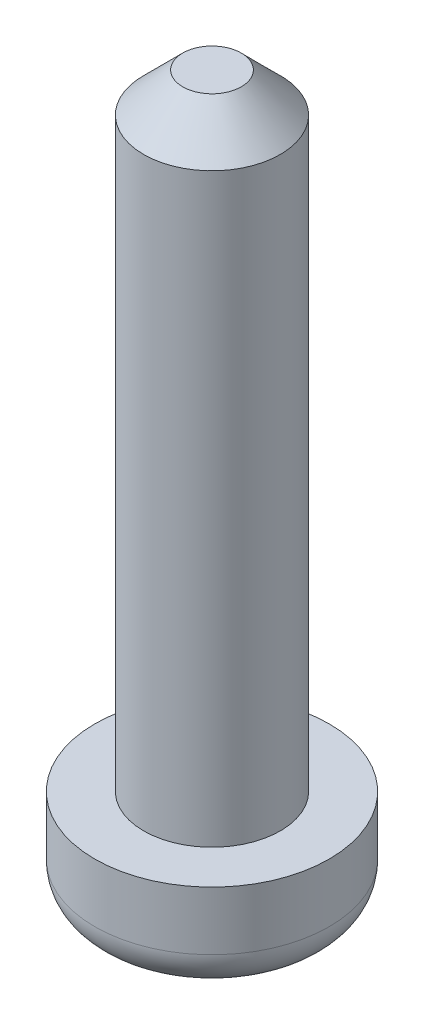
ISO-10303-21;
HEADER;
FILE_DESCRIPTION(('STEP AP214'),'2;1');
FILE_NAME('part.step','',(''),(''),'','','');
FILE_SCHEMA(('AUTOMOTIVE_DESIGN { 1 0 10303 214 1 1 1 1 }'));
ENDSEC;
DATA;
#1=APPLICATION_CONTEXT('core data for automotive mechanical design processes');
#2=APPLICATION_PROTOCOL_DEFINITION('international standard','automotive_design',2000,#1);
#3=PRODUCT_CONTEXT('',#1,'mechanical');
#4=PRODUCT('Part','Part','',(#3));
#5=PRODUCT_RELATED_PRODUCT_CATEGORY('part','',(#4));
#6=PRODUCT_DEFINITION_FORMATION('','',#4);
#7=PRODUCT_DEFINITION_CONTEXT('part definition',#1,'design');
#8=PRODUCT_DEFINITION('design','',#6,#7);
#9=PRODUCT_DEFINITION_SHAPE('','',#8);
#10=(LENGTH_UNIT() NAMED_UNIT(*) SI_UNIT(.MILLI.,.METRE.));
#11=(NAMED_UNIT(*) PLANE_ANGLE_UNIT() SI_UNIT($,.RADIAN.));
#12=(NAMED_UNIT(*) SI_UNIT($,.STERADIAN.) SOLID_ANGLE_UNIT());
#13=UNCERTAINTY_MEASURE_WITH_UNIT(LENGTH_MEASURE(1.E-05),#10,'distance_accuracy_value','');
#14=(GEOMETRIC_REPRESENTATION_CONTEXT(3) GLOBAL_UNCERTAINTY_ASSIGNED_CONTEXT((#13)) GLOBAL_UNIT_ASSIGNED_CONTEXT((#10,
#11,#12)) REPRESENTATION_CONTEXT('',''));
#15=CARTESIAN_POINT('',(0.,0.,0.));
#16=DIRECTION('',(0.,0.,1.));
#17=DIRECTION('',(1.,0.,0.));
#18=AXIS2_PLACEMENT_3D('',#15,#16,#17);
#19=CARTESIAN_POINT('',(0.,-2.5,0.));
#20=DIRECTION('',(0.,1.,0.));
#21=DIRECTION('',(0.,0.,1.));
#22=AXIS2_PLACEMENT_3D('',#19,#20,#21);
#23=PLANE('',#22);
#24=DIRECTION('',(0.,0.,1.));
#25=VECTOR('',#24,1.);
#26=CARTESIAN_POINT('',(0.5,-2.5,-0.5));
#27=LINE('',#26,#25);
#28=CARTESIAN_POINT('',(0.5,-2.5,-1.93649167310371));
#29=VERTEX_POINT('',#28);
#30=CARTESIAN_POINT('',(0.5,-2.5,-0.5));
#31=VERTEX_POINT('',#30);
#32=EDGE_CURVE('E225',#29,#31,#27,.T.);
#33=ORIENTED_EDGE('',*,*,#32,.F.);
#34=CARTESIAN_POINT('',(0.,-2.5,0.));
#35=DIRECTION('',(0.,1.,0.));
#36=DIRECTION('',(0.,0.,1.));
#37=AXIS2_PLACEMENT_3D('',#34,#35,#36);
#38=CIRCLE('',#37,2.);
#39=CARTESIAN_POINT('',(1.93649167310371,-2.5,-0.5));
#40=VERTEX_POINT('',#39);
#41=EDGE_CURVE('E274',#29,#40,#38,.F.);
#42=ORIENTED_EDGE('',*,*,#41,.T.);
#43=DIRECTION('',(1.,0.,0.));
#44=VECTOR('',#43,1.);
#45=CARTESIAN_POINT('',(0.5,-2.5,-0.5));
#46=LINE('',#45,#44);
#47=EDGE_CURVE('E227',#31,#40,#46,.T.);
#48=ORIENTED_EDGE('',*,*,#47,.F.);
#49=EDGE_LOOP('',(#33,#42,#48));
#50=FACE_BOUND('',#49,.T.);
#51=ADVANCED_FACE('F34',(#50),#23,.F.);
#52=DIRECTION('',(-1.,0.,0.));
#53=VECTOR('',#52,1.);
#54=CARTESIAN_POINT('',(0.5,-2.5,0.5));
#55=LINE('',#54,#53);
#56=CARTESIAN_POINT('',(1.93649167310371,-2.5,0.5));
#57=VERTEX_POINT('',#56);
#58=CARTESIAN_POINT('',(0.5,-2.5,0.5));
#59=VERTEX_POINT('',#58);
#60=EDGE_CURVE('E190',#57,#59,#55,.T.);
#61=ORIENTED_EDGE('',*,*,#60,.F.);
#62=CARTESIAN_POINT('',(0.,-2.5,0.));
#63=DIRECTION('',(0.,1.,0.));
#64=DIRECTION('',(0.,0.,1.));
#65=AXIS2_PLACEMENT_3D('',#62,#63,#64);
#66=CIRCLE('',#65,2.);
#67=CARTESIAN_POINT('',(0.5,-2.5,1.93649167310371));
#68=VERTEX_POINT('',#67);
#69=EDGE_CURVE('E272',#57,#68,#66,.F.);
#70=ORIENTED_EDGE('',*,*,#69,.T.);
#71=DIRECTION('',(0.,0.,1.));
#72=VECTOR('',#71,1.);
#73=CARTESIAN_POINT('',(0.5,-2.5,2.));
#74=LINE('',#73,#72);
#75=EDGE_CURVE('E187',#59,#68,#74,.T.);
#76=ORIENTED_EDGE('',*,*,#75,.F.);
#77=EDGE_LOOP('',(#61,#70,#76));
#78=FACE_BOUND('',#77,.T.);
#79=ADVANCED_FACE('F332',(#78),#23,.F.);
#80=DIRECTION('',(0.,0.,-1.));
#81=VECTOR('',#80,1.);
#82=CARTESIAN_POINT('',(-0.5,-2.5,2.));
#83=LINE('',#82,#81);
#84=CARTESIAN_POINT('',(-0.5,-2.5,1.93649167310371));
#85=VERTEX_POINT('',#84);
#86=CARTESIAN_POINT('',(-0.5,-2.5,0.5));
#87=VERTEX_POINT('',#86);
#88=EDGE_CURVE('E168',#85,#87,#83,.T.);
#89=ORIENTED_EDGE('',*,*,#88,.F.);
#90=CARTESIAN_POINT('',(0.,-2.5,0.));
#91=DIRECTION('',(0.,1.,0.));
#92=DIRECTION('',(0.,0.,1.));
#93=AXIS2_PLACEMENT_3D('',#90,#91,#92);
#94=CIRCLE('',#93,2.);
#95=CARTESIAN_POINT('',(-1.93649167310371,-2.5,0.5));
#96=VERTEX_POINT('',#95);
#97=EDGE_CURVE('E270',#85,#96,#94,.F.);
#98=ORIENTED_EDGE('',*,*,#97,.T.);
#99=DIRECTION('',(-1.,0.,0.));
#100=VECTOR('',#99,1.);
#101=CARTESIAN_POINT('',(-2.,-2.5,0.5));
#102=LINE('',#101,#100);
#103=EDGE_CURVE('E219',#87,#96,#102,.T.);
#104=ORIENTED_EDGE('',*,*,#103,.F.);
#105=EDGE_LOOP('',(#89,#98,#104));
#106=FACE_BOUND('',#105,.T.);
#107=ADVANCED_FACE('F339',(#106),#23,.F.);
#108=CARTESIAN_POINT('',(0.,16.,0.));
#109=DIRECTION('',(0.,-1.,0.));
#110=DIRECTION('',(0.,0.,-1.));
#111=AXIS2_PLACEMENT_3D('',#108,#109,#110);
#112=CYLINDRICAL_SURFACE('',#111,1.75);
#113=CARTESIAN_POINT('',(0.,15.,0.));
#114=DIRECTION('',(0.,1.,0.));
#115=DIRECTION('',(0.,0.,1.));
#116=AXIS2_PLACEMENT_3D('',#113,#114,#115);
#117=CIRCLE('',#116,1.75);
#118=CARTESIAN_POINT('',(0.,15.,1.75));
#119=VERTEX_POINT('',#118);
#120=EDGE_CURVE('E11',#119,#119,#117,.F.);
#121=ORIENTED_EDGE('',*,*,#120,.T.);
#122=EDGE_LOOP('',(#121));
#123=FACE_BOUND('',#122,.T.);
#124=CARTESIAN_POINT('',(0.,0.,0.));
#125=DIRECTION('',(0.,1.,0.));
#126=DIRECTION('',(0.,0.,1.));
#127=AXIS2_PLACEMENT_3D('',#124,#125,#126);
#128=CIRCLE('',#127,1.75);
#129=CARTESIAN_POINT('',(0.,0.,1.75));
#130=VERTEX_POINT('',#129);
#131=EDGE_CURVE('E262',#130,#130,#128,.T.);
#132=ORIENTED_EDGE('',*,*,#131,.T.);
#133=EDGE_LOOP('',(#132));
#134=FACE_BOUND('',#133,.T.);
#135=ADVANCED_FACE('F357',(#123,#134),#112,.T.);
#136=CARTESIAN_POINT('',(0.,16.,0.));
#137=DIRECTION('',(0.,1.,0.));
#138=DIRECTION('',(0.,0.,1.));
#139=AXIS2_PLACEMENT_3D('',#136,#137,#138);
#140=PLANE('',#139);
#141=CARTESIAN_POINT('',(0.,16.,0.));
#142=DIRECTION('',(0.,1.,0.));
#143=DIRECTION('',(0.,0.,1.));
#144=AXIS2_PLACEMENT_3D('',#141,#142,#143);
#145=CIRCLE('',#144,0.750000000000001);
#146=CARTESIAN_POINT('',(0.,16.,0.750000000000001));
#147=VERTEX_POINT('',#146);
#148=EDGE_CURVE('E42',#147,#147,#145,.T.);
#149=ORIENTED_EDGE('',*,*,#148,.T.);
#150=EDGE_LOOP('',(#149));
#151=FACE_BOUND('',#150,.T.);
#152=ADVANCED_FACE('F322',(#151),#140,.T.);
#153=CARTESIAN_POINT('',(0.,0.,0.));
#154=DIRECTION('',(0.,1.,0.));
#155=DIRECTION('',(0.,0.,1.));
#156=AXIS2_PLACEMENT_3D('',#153,#154,#155);
#157=PLANE('',#156);
#158=CARTESIAN_POINT('',(0.,0.,0.));
#159=DIRECTION('',(0.,1.,0.));
#160=DIRECTION('',(0.,0.,1.));
#161=AXIS2_PLACEMENT_3D('',#158,#159,#160);
#162=CIRCLE('',#161,3.);
#163=CARTESIAN_POINT('',(0.,0.,3.));
#164=VERTEX_POINT('',#163);
#165=EDGE_CURVE('E233',#164,#164,#162,.T.);
#166=ORIENTED_EDGE('',*,*,#165,.T.);
#167=EDGE_LOOP('',(#166));
#168=FACE_BOUND('',#167,.T.);
#169=ORIENTED_EDGE('',*,*,#131,.F.);
#170=EDGE_LOOP('',(#169));
#171=FACE_BOUND('',#170,.T.);
#172=ADVANCED_FACE('F352',(#168,#171),#157,.T.);
#173=CARTESIAN_POINT('',(0.,-2.5,0.));
#174=DIRECTION('',(0.,1.,0.));
#175=DIRECTION('',(0.,0.,1.));
#176=AXIS2_PLACEMENT_3D('',#173,#174,#175);
#177=CYLINDRICAL_SURFACE('',#176,3.);
#178=CARTESIAN_POINT('',(0.,-1.5,0.));
#179=DIRECTION('',(0.,1.,0.));
#180=DIRECTION('',(0.,0.,1.));
#181=AXIS2_PLACEMENT_3D('',#178,#179,#180);
#182=CIRCLE('',#181,3.);
#183=CARTESIAN_POINT('',(0.,-1.5,3.));
#184=VERTEX_POINT('',#183);
#185=EDGE_CURVE('E265',#184,#184,#182,.T.);
#186=ORIENTED_EDGE('',*,*,#185,.T.);
#187=EDGE_LOOP('',(#186));
#188=FACE_BOUND('',#187,.T.);
#189=ORIENTED_EDGE('',*,*,#165,.F.);
#190=EDGE_LOOP('',(#189));
#191=FACE_BOUND('',#190,.T.);
#192=ADVANCED_FACE('F345',(#188,#191),#177,.T.);
#193=DIRECTION('',(1.,0.,0.));
#194=VECTOR('',#193,1.);
#195=CARTESIAN_POINT('',(-2.,-2.5,-0.5));
#196=LINE('',#195,#194);
#197=CARTESIAN_POINT('',(-1.93649167310371,-2.5,-0.5));
#198=VERTEX_POINT('',#197);
#199=CARTESIAN_POINT('',(-0.5,-2.5,-0.5));
#200=VERTEX_POINT('',#199);
#201=EDGE_CURVE('E221',#198,#200,#196,.T.);
#202=ORIENTED_EDGE('',*,*,#201,.F.);
#203=CARTESIAN_POINT('',(0.,-2.5,0.));
#204=DIRECTION('',(0.,1.,0.));
#205=DIRECTION('',(0.,0.,1.));
#206=AXIS2_PLACEMENT_3D('',#203,#204,#205);
#207=CIRCLE('',#206,2.);
#208=CARTESIAN_POINT('',(-0.499999999999999,-2.5,-1.93649167310371));
#209=VERTEX_POINT('',#208);
#210=EDGE_CURVE('E268',#198,#209,#207,.F.);
#211=ORIENTED_EDGE('',*,*,#210,.T.);
#212=DIRECTION('',(0.,0.,-1.));
#213=VECTOR('',#212,1.);
#214=CARTESIAN_POINT('',(-0.5,-2.5,-0.5));
#215=LINE('',#214,#213);
#216=EDGE_CURVE('E223',#200,#209,#215,.T.);
#217=ORIENTED_EDGE('',*,*,#216,.F.);
#218=EDGE_LOOP('',(#202,#211,#217));
#219=FACE_BOUND('',#218,.T.);
#220=ADVANCED_FACE('F335',(#219),#23,.F.);
#221=CARTESIAN_POINT('',(-0.5,-1.,2.));
#222=DIRECTION('',(-1.,0.,0.));
#223=DIRECTION('',(0.,0.,1.));
#224=AXIS2_PLACEMENT_3D('',#221,#222,#223);
#225=PLANE('',#224);
#226=DIRECTION('',(0.,-1.,0.));
#227=VECTOR('',#226,1.);
#228=CARTESIAN_POINT('',(-0.5,-1.,2.));
#229=LINE('',#228,#227);
#230=CARTESIAN_POINT('',(-0.5,-1.,2.));
#231=VERTEX_POINT('',#230);
#232=CARTESIAN_POINT('',(-0.5,-2.49810382788331,2.));
#233=VERTEX_POINT('',#232);
#234=EDGE_CURVE('E231',#231,#233,#229,.T.);
#235=ORIENTED_EDGE('',*,*,#234,.T.);
#236=CARTESIAN_POINT('',(-0.5,-2.49810382788331,2.));
#237=CARTESIAN_POINT('',(-0.5,-2.49873613740419,1.98942471979247));
#238=CARTESIAN_POINT('',(-0.5,-2.49921030650765,1.97884471797704));
#239=CARTESIAN_POINT('',(-0.5,-2.49984236374411,1.95767527567422));
#240=CARTESIAN_POINT('',(-0.5,-2.50000025201287,1.94708583519089));
#241=CARTESIAN_POINT('',(-0.5,-2.5,1.93649167310371));
#242=B_SPLINE_CURVE_WITH_KNOTS('',3,(#236,#237,#238,#239,#240,#241),.UNSPECIFIED.,.F.,.F.,(4,2,
4),(0.,0.031771866057538,0.0635437184759891),.UNSPECIFIED.);
#243=EDGE_CURVE('E368',#233,#85,#242,.T.);
#244=ORIENTED_EDGE('',*,*,#243,.T.);
#245=ORIENTED_EDGE('',*,*,#88,.T.);
#246=DIRECTION('',(0.,-1.,0.));
#247=VECTOR('',#246,1.);
#248=CARTESIAN_POINT('',(-0.5,-1.,0.5));
#249=LINE('',#248,#247);
#250=CARTESIAN_POINT('',(-0.5,-1.,0.5));
#251=VERTEX_POINT('',#250);
#252=EDGE_CURVE('E160',#251,#87,#249,.T.);
#253=ORIENTED_EDGE('',*,*,#252,.F.);
#254=DIRECTION('',(0.,0.,-1.));
#255=VECTOR('',#254,1.);
#256=CARTESIAN_POINT('',(-0.5,-1.,2.));
#257=LINE('',#256,#255);
#258=EDGE_CURVE('E165',#231,#251,#257,.T.);
#259=ORIENTED_EDGE('',*,*,#258,.F.);
#260=EDGE_LOOP('',(#235,#244,#245,#253,#259));
#261=FACE_BOUND('',#260,.T.);
#262=ADVANCED_FACE('F163',(#261),#225,.F.);
#263=CARTESIAN_POINT('',(-0.5,-1.,2.));
#264=DIRECTION('',(0.,0.,1.));
#265=DIRECTION('',(1.,0.,0.));
#266=AXIS2_PLACEMENT_3D('',#263,#264,#265);
#267=PLANE('',#266);
#268=DIRECTION('',(0.,-1.,0.));
#269=VECTOR('',#268,1.);
#270=CARTESIAN_POINT('',(0.5,-1.,2.));
#271=LINE('',#270,#269);
#272=CARTESIAN_POINT('',(0.5,-1.,2.));
#273=VERTEX_POINT('',#272);
#274=CARTESIAN_POINT('',(0.5,-2.49810382788331,2.));
#275=VERTEX_POINT('',#274);
#276=EDGE_CURVE('E234',#273,#275,#271,.T.);
#277=ORIENTED_EDGE('',*,*,#276,.T.);
#278=CARTESIAN_POINT('',(0.5,-2.49810382788331,2.));
#279=CARTESIAN_POINT('',(0.458335870114963,-2.49871927499959,2.));
#280=CARTESIAN_POINT('',(0.416669825898215,-2.49912271045823,2.));
#281=CARTESIAN_POINT('',(0.333336381846007,-2.49966217861315,2.));
#282=CARTESIAN_POINT('',(0.291668982035286,-2.49979821479386,2.));
#283=CARTESIAN_POINT('',(0.208334906185428,-2.49995951148175,2.));
#284=CARTESIAN_POINT('',(0.166668230145768,-2.49998477382938,2.));
#285=CARTESIAN_POINT('',(0.0833343803536449,-2.499999996389,2.));
#286=CARTESIAN_POINT('',(0.0416672066009839,-2.49998995619378,2.));
#287=CARTESIAN_POINT('',(0.,-2.5,2.));
#288=B_SPLINE_CURVE_WITH_KNOTS('',3,(#278,#279,#280,#281,#282,#283,#284,#285,#286,#287),
.UNSPECIFIED.,.F.,.F.,(4,2,2,2,4),(0.,0.125003809730226,0.250005990551509,0.375006094513465,
0.500007640298941),.UNSPECIFIED.);
#289=CARTESIAN_POINT('',(0.,-2.5,2.));
#290=VERTEX_POINT('',#289);
#291=EDGE_CURVE('E376',#275,#290,#288,.T.);
#292=ORIENTED_EDGE('',*,*,#291,.T.);
#293=CARTESIAN_POINT('',(0.,-2.5,2.));
#294=CARTESIAN_POINT('',(-0.0416672066009838,-2.49998995619378,2.));
#295=CARTESIAN_POINT('',(-0.0833343803536449,-2.499999996389,2.));
#296=CARTESIAN_POINT('',(-0.166668230145768,-2.49998477382938,2.));
#297=CARTESIAN_POINT('',(-0.208334906185428,-2.49995951148175,2.));
#298=CARTESIAN_POINT('',(-0.291668982035286,-2.49979821479386,2.));
#299=CARTESIAN_POINT('',(-0.333336381846007,-2.49966217861315,2.));
#300=CARTESIAN_POINT('',(-0.416669825898215,-2.49912271045823,2.));
#301=CARTESIAN_POINT('',(-0.458335870114963,-2.49871927499959,2.));
#302=CARTESIAN_POINT('',(-0.5,-2.49810382788331,2.));
#303=B_SPLINE_CURVE_WITH_KNOTS('',3,(#293,#294,#295,#296,#297,#298,#299,#300,#301,#302),
.UNSPECIFIED.,.F.,.F.,(4,2,2,2,4),(0.,0.125001545785476,0.250001649747432,0.375003830568715,
0.500007640298941),.UNSPECIFIED.);
#304=EDGE_CURVE('E453',#290,#233,#303,.T.);
#305=ORIENTED_EDGE('',*,*,#304,.T.);
#306=ORIENTED_EDGE('',*,*,#234,.F.);
#307=DIRECTION('',(-1.,0.,0.));
#308=VECTOR('',#307,1.);
#309=CARTESIAN_POINT('',(-0.5,-1.,2.));
#310=LINE('',#309,#308);
#311=EDGE_CURVE('E173',#273,#231,#310,.T.);
#312=ORIENTED_EDGE('',*,*,#311,.F.);
#313=EDGE_LOOP('',(#277,#292,#305,#306,#312));
#314=FACE_BOUND('',#313,.T.);
#315=ADVANCED_FACE('F351',(#314),#267,.F.);
#316=CARTESIAN_POINT('',(0.5,-1.,2.));
#317=DIRECTION('',(1.,0.,0.));
#318=DIRECTION('',(0.,0.,-1.));
#319=AXIS2_PLACEMENT_3D('',#316,#317,#318);
#320=PLANE('',#319);
#321=ORIENTED_EDGE('',*,*,#75,.T.);
#322=CARTESIAN_POINT('',(0.5,-2.5,1.93649167310371));
#323=CARTESIAN_POINT('',(0.5,-2.50000025201287,1.94708583519089));
#324=CARTESIAN_POINT('',(0.5,-2.49984236374411,1.95767527567422));
#325=CARTESIAN_POINT('',(0.5,-2.49921030650765,1.97884471797704));
#326=CARTESIAN_POINT('',(0.5,-2.49873613740419,1.98942471979247));
#327=CARTESIAN_POINT('',(0.5,-2.49810382788331,2.));
#328=B_SPLINE_CURVE_WITH_KNOTS('',3,(#322,#323,#324,#325,#326,#327),.UNSPECIFIED.,.F.,.F.,(4,2,
4),(0.,0.0317718524184509,0.0635437184759893),.UNSPECIFIED.);
#329=EDGE_CURVE('E449',#68,#275,#328,.T.);
#330=ORIENTED_EDGE('',*,*,#329,.T.);
#331=ORIENTED_EDGE('',*,*,#276,.F.);
#332=DIRECTION('',(0.,0.,1.));
#333=VECTOR('',#332,1.);
#334=CARTESIAN_POINT('',(0.5,-1.,2.));
#335=LINE('',#334,#333);
#336=CARTESIAN_POINT('',(0.5,-1.,0.5));
#337=VERTEX_POINT('',#336);
#338=EDGE_CURVE('E215',#337,#273,#335,.T.);
#339=ORIENTED_EDGE('',*,*,#338,.F.);
#340=DIRECTION('',(0.,-1.,0.));
#341=VECTOR('',#340,1.);
#342=CARTESIAN_POINT('',(0.5,-1.,0.5));
#343=LINE('',#342,#341);
#344=EDGE_CURVE('E237',#337,#59,#343,.T.);
#345=ORIENTED_EDGE('',*,*,#344,.T.);
#346=EDGE_LOOP('',(#321,#330,#331,#339,#345));
#347=FACE_BOUND('',#346,.T.);
#348=ADVANCED_FACE('F447',(#347),#320,.F.);
#349=CARTESIAN_POINT('',(0.5,-1.,0.5));
#350=DIRECTION('',(0.,0.,1.));
#351=DIRECTION('',(1.,0.,0.));
#352=AXIS2_PLACEMENT_3D('',#349,#350,#351);
#353=PLANE('',#352);
#354=DIRECTION('',(0.,-1.,0.));
#355=VECTOR('',#354,1.);
#356=CARTESIAN_POINT('',(2.,-1.,0.5));
#357=LINE('',#356,#355);
#358=CARTESIAN_POINT('',(2.,-1.,0.5));
#359=VERTEX_POINT('',#358);
#360=CARTESIAN_POINT('',(2.,-2.49810382788331,0.5));
#361=VERTEX_POINT('',#360);
#362=EDGE_CURVE('E240',#359,#361,#357,.T.);
#363=ORIENTED_EDGE('',*,*,#362,.T.);
#364=CARTESIAN_POINT('',(2.,-2.49810382788331,0.5));
#365=CARTESIAN_POINT('',(1.98942471979247,-2.49873613740419,0.5));
#366=CARTESIAN_POINT('',(1.97884471797704,-2.49921030650765,0.5));
#367=CARTESIAN_POINT('',(1.95767527567422,-2.49984236374411,0.5));
#368=CARTESIAN_POINT('',(1.94708583519089,-2.50000025201287,0.5));
#369=CARTESIAN_POINT('',(1.93649167310371,-2.5,0.5));
#370=B_SPLINE_CURVE_WITH_KNOTS('',3,(#364,#365,#366,#367,#368,#369),.UNSPECIFIED.,.F.,.F.,(4,2,
4),(0.,0.0317718660575385,0.0635437184759895),.UNSPECIFIED.);
#371=EDGE_CURVE('E475',#361,#57,#370,.T.);
#372=ORIENTED_EDGE('',*,*,#371,.T.);
#373=ORIENTED_EDGE('',*,*,#60,.T.);
#374=ORIENTED_EDGE('',*,*,#344,.F.);
#375=DIRECTION('',(-1.,0.,0.));
#376=VECTOR('',#375,1.);
#377=CARTESIAN_POINT('',(0.5,-1.,0.5));
#378=LINE('',#377,#376);
#379=EDGE_CURVE('E212',#359,#337,#378,.T.);
#380=ORIENTED_EDGE('',*,*,#379,.F.);
#381=EDGE_LOOP('',(#363,#372,#373,#374,#380));
#382=FACE_BOUND('',#381,.T.);
#383=ADVANCED_FACE('F442',(#382),#353,.F.);
#384=CARTESIAN_POINT('',(2.,-1.,0.5));
#385=DIRECTION('',(1.,0.,0.));
#386=DIRECTION('',(0.,0.,-1.));
#387=AXIS2_PLACEMENT_3D('',#384,#385,#386);
#388=PLANE('',#387);
#389=DIRECTION('',(0.,-1.,0.));
#390=VECTOR('',#389,1.);
#391=CARTESIAN_POINT('',(2.,-1.,-0.5));
#392=LINE('',#391,#390);
#393=CARTESIAN_POINT('',(2.,-1.,-0.5));
#394=VERTEX_POINT('',#393);
#395=CARTESIAN_POINT('',(2.,-2.49810382788331,-0.5));
#396=VERTEX_POINT('',#395);
#397=EDGE_CURVE('E243',#394,#396,#392,.T.);
#398=ORIENTED_EDGE('',*,*,#397,.T.);
#399=CARTESIAN_POINT('',(2.,-2.49810382788331,-0.5));
#400=CARTESIAN_POINT('',(2.,-2.49871927499959,-0.458335870114963));
#401=CARTESIAN_POINT('',(2.,-2.49912271045823,-0.416669825898216));
#402=CARTESIAN_POINT('',(2.,-2.49966217861315,-0.333336381846008));
#403=CARTESIAN_POINT('',(2.,-2.49979821479386,-0.291668982035286));
#404=CARTESIAN_POINT('',(2.,-2.49995951148175,-0.208334906185429));
#405=CARTESIAN_POINT('',(2.,-2.49998477382938,-0.166668230145769));
#406=CARTESIAN_POINT('',(2.,-2.499999996389,-0.0833343803536463));
#407=CARTESIAN_POINT('',(2.,-2.49998995619378,-0.0416672066009854));
#408=CARTESIAN_POINT('',(2.,-2.5,0.));
#409=B_SPLINE_CURVE_WITH_KNOTS('',3,(#399,#400,#401,#402,#403,#404,#405,#406,#407,#408),
.UNSPECIFIED.,.F.,.F.,(4,2,2,2,4),(0.,0.125003809730226,0.250005990551508,0.375006094513464,
0.500007640298939),.UNSPECIFIED.);
#410=CARTESIAN_POINT('',(2.,-2.5,0.));
#411=VERTEX_POINT('',#410);
#412=EDGE_CURVE('E479',#396,#411,#409,.T.);
#413=ORIENTED_EDGE('',*,*,#412,.T.);
#414=CARTESIAN_POINT('',(2.,-2.5,0.));
#415=CARTESIAN_POINT('',(2.,-2.49998995619378,0.0416672066009822));
#416=CARTESIAN_POINT('',(2.,-2.499999996389,0.0833343803536434));
#417=CARTESIAN_POINT('',(2.,-2.49998477382938,0.166668230145767));
#418=CARTESIAN_POINT('',(2.,-2.49995951148175,0.208334906185427));
#419=CARTESIAN_POINT('',(2.,-2.49979821479386,0.291668982035285));
#420=CARTESIAN_POINT('',(2.,-2.49966217861315,0.333336381846006));
#421=CARTESIAN_POINT('',(2.,-2.49912271045823,0.416669825898215));
#422=CARTESIAN_POINT('',(2.,-2.49871927499959,0.458335870114962));
#423=CARTESIAN_POINT('',(2.,-2.49810382788331,0.5));
#424=B_SPLINE_CURVE_WITH_KNOTS('',3,(#414,#415,#416,#417,#418,#419,#420,#421,#422,#423),
.UNSPECIFIED.,.F.,.F.,(4,2,2,2,4),(0.,0.125001545785476,0.250001649747433,0.375003830568716,
0.500007640298943),.UNSPECIFIED.);
#425=EDGE_CURVE('E283',#411,#361,#424,.T.);
#426=ORIENTED_EDGE('',*,*,#425,.T.);
#427=ORIENTED_EDGE('',*,*,#362,.F.);
#428=DIRECTION('',(0.,0.,1.));
#429=VECTOR('',#428,1.);
#430=CARTESIAN_POINT('',(2.,-1.,0.5));
#431=LINE('',#430,#429);
#432=EDGE_CURVE('E209',#394,#359,#431,.T.);
#433=ORIENTED_EDGE('',*,*,#432,.F.);
#434=EDGE_LOOP('',(#398,#413,#426,#427,#433));
#435=FACE_BOUND('',#434,.T.);
#436=ADVANCED_FACE('F297',(#435),#388,.F.);
#437=CARTESIAN_POINT('',(0.5,-1.,-0.5));
#438=DIRECTION('',(0.,0.,-1.));
#439=DIRECTION('',(-1.,0.,0.));
#440=AXIS2_PLACEMENT_3D('',#437,#438,#439);
#441=PLANE('',#440);
#442=ORIENTED_EDGE('',*,*,#47,.T.);
#443=CARTESIAN_POINT('',(1.93649167310371,-2.5,-0.5));
#444=CARTESIAN_POINT('',(1.94708583519089,-2.50000025201287,-0.5));
#445=CARTESIAN_POINT('',(1.95767527567422,-2.49984236374411,-0.5));
#446=CARTESIAN_POINT('',(1.97884471797704,-2.49921030650765,-0.5));
#447=CARTESIAN_POINT('',(1.98942471979247,-2.49873613740419,-0.5));
#448=CARTESIAN_POINT('',(2.,-2.49810382788331,-0.5));
#449=B_SPLINE_CURVE_WITH_KNOTS('',3,(#443,#444,#445,#446,#447,#448),.UNSPECIFIED.,.F.,.F.,(4,2,
4),(0.,0.0317718524184509,0.0635437184759889),.UNSPECIFIED.);
#450=EDGE_CURVE('E277',#40,#396,#449,.T.);
#451=ORIENTED_EDGE('',*,*,#450,.T.);
#452=ORIENTED_EDGE('',*,*,#397,.F.);
#453=DIRECTION('',(1.,0.,0.));
#454=VECTOR('',#453,1.);
#455=CARTESIAN_POINT('',(0.5,-1.,-0.5));
#456=LINE('',#455,#454);
#457=CARTESIAN_POINT('',(0.5,-1.,-0.5));
#458=VERTEX_POINT('',#457);
#459=EDGE_CURVE('E206',#458,#394,#456,.T.);
#460=ORIENTED_EDGE('',*,*,#459,.F.);
#461=DIRECTION('',(0.,-1.,0.));
#462=VECTOR('',#461,1.);
#463=CARTESIAN_POINT('',(0.5,-1.,-0.5));
#464=LINE('',#463,#462);
#465=EDGE_CURVE('E246',#458,#31,#464,.T.);
#466=ORIENTED_EDGE('',*,*,#465,.T.);
#467=EDGE_LOOP('',(#442,#451,#452,#460,#466));
#468=FACE_BOUND('',#467,.T.);
#469=ADVANCED_FACE('F292',(#468),#441,.F.);
#470=CARTESIAN_POINT('',(0.5,-1.,-0.5));
#471=DIRECTION('',(1.,0.,0.));
#472=DIRECTION('',(0.,0.,-1.));
#473=AXIS2_PLACEMENT_3D('',#470,#471,#472);
#474=PLANE('',#473);
#475=DIRECTION('',(0.,-1.,0.));
#476=VECTOR('',#475,1.);
#477=CARTESIAN_POINT('',(0.5,-1.,-2.));
#478=LINE('',#477,#476);
#479=CARTESIAN_POINT('',(0.5,-1.,-2.));
#480=VERTEX_POINT('',#479);
#481=CARTESIAN_POINT('',(0.5,-2.49810382788331,-2.));
#482=VERTEX_POINT('',#481);
#483=EDGE_CURVE('E249',#480,#482,#478,.T.);
#484=ORIENTED_EDGE('',*,*,#483,.T.);
#485=CARTESIAN_POINT('',(0.5,-2.49810382788331,-2.));
#486=CARTESIAN_POINT('',(0.5,-2.49873613740419,-1.98942471979247));
#487=CARTESIAN_POINT('',(0.5,-2.49921030650765,-1.97884471797704));
#488=CARTESIAN_POINT('',(0.5,-2.49984236374411,-1.95767527567422));
#489=CARTESIAN_POINT('',(0.5,-2.50000025201287,-1.94708583519089));
#490=CARTESIAN_POINT('',(0.5,-2.5,-1.93649167310371));
#491=B_SPLINE_CURVE_WITH_KNOTS('',3,(#485,#486,#487,#488,#489,#490),.UNSPECIFIED.,.F.,.F.,(4,2,
4),(0.,0.031771866057538,0.0635437184759891),.UNSPECIFIED.);
#492=EDGE_CURVE('E309',#482,#29,#491,.T.);
#493=ORIENTED_EDGE('',*,*,#492,.T.);
#494=ORIENTED_EDGE('',*,*,#32,.T.);
#495=ORIENTED_EDGE('',*,*,#465,.F.);
#496=DIRECTION('',(0.,0.,1.));
#497=VECTOR('',#496,1.);
#498=CARTESIAN_POINT('',(0.5,-1.,-0.5));
#499=LINE('',#498,#497);
#500=EDGE_CURVE('E203',#480,#458,#499,.T.);
#501=ORIENTED_EDGE('',*,*,#500,.F.);
#502=EDGE_LOOP('',(#484,#493,#494,#495,#501));
#503=FACE_BOUND('',#502,.T.);
#504=ADVANCED_FACE('F296',(#503),#474,.F.);
#505=CARTESIAN_POINT('',(-0.499999999999999,-1.,-2.));
#506=DIRECTION('',(0.,0.,-1.));
#507=DIRECTION('',(-1.,0.,0.));
#508=AXIS2_PLACEMENT_3D('',#505,#506,#507);
#509=PLANE('',#508);
#510=DIRECTION('',(0.,-1.,0.));
#511=VECTOR('',#510,1.);
#512=CARTESIAN_POINT('',(-0.499999999999999,-1.,-2.));
#513=LINE('',#512,#511);
#514=CARTESIAN_POINT('',(-0.499999999999999,-1.,-2.));
#515=VERTEX_POINT('',#514);
#516=CARTESIAN_POINT('',(-0.499999999999999,-2.49810382788331,-2.));
#517=VERTEX_POINT('',#516);
#518=EDGE_CURVE('E251',#515,#517,#513,.T.);
#519=ORIENTED_EDGE('',*,*,#518,.T.);
#520=CARTESIAN_POINT('',(-0.499999999999999,-2.49810382788331,-2.));
#521=CARTESIAN_POINT('',(-0.458335870114962,-2.49871927499959,-2.));
#522=CARTESIAN_POINT('',(-0.416669825898215,-2.49912271045823,-2.));
#523=CARTESIAN_POINT('',(-0.333336381846006,-2.49966217861315,-2.));
#524=CARTESIAN_POINT('',(-0.291668982035285,-2.49979821479386,-2.));
#525=CARTESIAN_POINT('',(-0.208334906185427,-2.49995951148175,-2.));
#526=CARTESIAN_POINT('',(-0.166668230145767,-2.49998477382938,-2.));
#527=CARTESIAN_POINT('',(-0.083334380353644,-2.499999996389,-2.));
#528=CARTESIAN_POINT('',(-0.0416672066009829,-2.49998995619378,-2.));
#529=CARTESIAN_POINT('',(0.,-2.5,-2.));
#530=B_SPLINE_CURVE_WITH_KNOTS('',3,(#520,#521,#522,#523,#524,#525,#526,#527,#528,#529),
.UNSPECIFIED.,.F.,.F.,(4,2,2,2,4),(0.,0.125003809730227,0.250005990551509,0.375006094513465,
0.500007640298942),.UNSPECIFIED.);
#531=CARTESIAN_POINT('',(0.,-2.5,-2.));
#532=VERTEX_POINT('',#531);
#533=EDGE_CURVE('E314',#517,#532,#530,.T.);
#534=ORIENTED_EDGE('',*,*,#533,.T.);
#535=CARTESIAN_POINT('',(0.,-2.5,-2.));
#536=CARTESIAN_POINT('',(0.0416672066009846,-2.49998995619378,-2.));
#537=CARTESIAN_POINT('',(0.0833343803536456,-2.499999996389,-2.));
#538=CARTESIAN_POINT('',(0.166668230145769,-2.49998477382938,-2.));
#539=CARTESIAN_POINT('',(0.208334906185428,-2.49995951148175,-2.));
#540=CARTESIAN_POINT('',(0.291668982035286,-2.49979821479386,-2.));
#541=CARTESIAN_POINT('',(0.333336381846008,-2.49966217861315,-2.));
#542=CARTESIAN_POINT('',(0.416669825898216,-2.49912271045823,-2.));
#543=CARTESIAN_POINT('',(0.458335870114963,-2.49871927499959,-2.));
#544=CARTESIAN_POINT('',(0.5,-2.49810382788331,-2.));
#545=B_SPLINE_CURVE_WITH_KNOTS('',3,(#535,#536,#537,#538,#539,#540,#541,#542,#543,#544),
.UNSPECIFIED.,.F.,.F.,(4,2,2,2,4),(0.,0.125001545785476,0.250001649747432,0.375003830568714,
0.500007640298941),.UNSPECIFIED.);
#546=EDGE_CURVE('E49',#532,#482,#545,.T.);
#547=ORIENTED_EDGE('',*,*,#546,.T.);
#548=ORIENTED_EDGE('',*,*,#483,.F.);
#549=DIRECTION('',(1.,0.,0.));
#550=VECTOR('',#549,1.);
#551=CARTESIAN_POINT('',(-0.499999999999999,-1.,-2.));
#552=LINE('',#551,#550);
#553=EDGE_CURVE('E200',#515,#480,#552,.T.);
#554=ORIENTED_EDGE('',*,*,#553,.F.);
#555=EDGE_LOOP('',(#519,#534,#547,#548,#554));
#556=FACE_BOUND('',#555,.T.);
#557=ADVANCED_FACE('F304',(#556),#509,.F.);
#558=CARTESIAN_POINT('',(-0.5,-1.,-0.5));
#559=DIRECTION('',(-1.,0.,0.));
#560=DIRECTION('',(0.,0.,1.));
#561=AXIS2_PLACEMENT_3D('',#558,#559,#560);
#562=PLANE('',#561);
#563=ORIENTED_EDGE('',*,*,#216,.T.);
#564=CARTESIAN_POINT('',(-0.499999999999999,-2.5,-1.93649167310371));
#565=CARTESIAN_POINT('',(-0.499999999999999,-2.50000025201287,-1.94708583519089));
#566=CARTESIAN_POINT('',(-0.499999999999999,-2.49984236374411,-1.95767527567422));
#567=CARTESIAN_POINT('',(-0.499999999999999,-2.49921030650765,-1.97884471797704));
#568=CARTESIAN_POINT('',(-0.499999999999999,-2.49873613740419,-1.98942471979247));
#569=CARTESIAN_POINT('',(-0.499999999999999,-2.49810382788331,-2.));
#570=B_SPLINE_CURVE_WITH_KNOTS('',3,(#564,#565,#566,#567,#568,#569),.UNSPECIFIED.,.F.,.F.,(4,2,
4),(0.,0.0317718524184513,0.0635437184759898),.UNSPECIFIED.);
#571=EDGE_CURVE('E57',#209,#517,#570,.T.);
#572=ORIENTED_EDGE('',*,*,#571,.T.);
#573=ORIENTED_EDGE('',*,*,#518,.F.);
#574=DIRECTION('',(0.,0.,-1.));
#575=VECTOR('',#574,1.);
#576=CARTESIAN_POINT('',(-0.5,-1.,-0.5));
#577=LINE('',#576,#575);
#578=CARTESIAN_POINT('',(-0.5,-1.,-0.5));
#579=VERTEX_POINT('',#578);
#580=EDGE_CURVE('E197',#579,#515,#577,.T.);
#581=ORIENTED_EDGE('',*,*,#580,.F.);
#582=DIRECTION('',(0.,-1.,0.));
#583=VECTOR('',#582,1.);
#584=CARTESIAN_POINT('',(-0.5,-1.,-0.5));
#585=LINE('',#584,#583);
#586=EDGE_CURVE('E253',#579,#200,#585,.T.);
#587=ORIENTED_EDGE('',*,*,#586,.T.);
#588=EDGE_LOOP('',(#563,#572,#573,#581,#587));
#589=FACE_BOUND('',#588,.T.);
#590=ADVANCED_FACE('F417',(#589),#562,.F.);
#591=CARTESIAN_POINT('',(-2.,-1.,-0.5));
#592=DIRECTION('',(0.,0.,-1.));
#593=DIRECTION('',(-1.,0.,0.));
#594=AXIS2_PLACEMENT_3D('',#591,#592,#593);
#595=PLANE('',#594);
#596=DIRECTION('',(0.,-1.,0.));
#597=VECTOR('',#596,1.);
#598=CARTESIAN_POINT('',(-2.,-1.,-0.5));
#599=LINE('',#598,#597);
#600=CARTESIAN_POINT('',(-2.,-1.,-0.5));
#601=VERTEX_POINT('',#600);
#602=CARTESIAN_POINT('',(-2.,-2.49810382788331,-0.5));
#603=VERTEX_POINT('',#602);
#604=EDGE_CURVE('E256',#601,#603,#599,.T.);
#605=ORIENTED_EDGE('',*,*,#604,.T.);
#606=CARTESIAN_POINT('',(-2.,-2.49810382788331,-0.5));
#607=CARTESIAN_POINT('',(-1.98942471979247,-2.49873613740419,-0.5));
#608=CARTESIAN_POINT('',(-1.97884471797704,-2.49921030650765,-0.5));
#609=CARTESIAN_POINT('',(-1.95767527567422,-2.49984236374411,-0.5));
#610=CARTESIAN_POINT('',(-1.94708583519089,-2.50000025201287,-0.5));
#611=CARTESIAN_POINT('',(-1.93649167310371,-2.5,-0.5));
#612=B_SPLINE_CURVE_WITH_KNOTS('',3,(#606,#607,#608,#609,#610,#611),.UNSPECIFIED.,.F.,.F.,(4,2,
4),(0.,0.0317718660575385,0.0635437184759895),.UNSPECIFIED.);
#613=EDGE_CURVE('E406',#603,#198,#612,.T.);
#614=ORIENTED_EDGE('',*,*,#613,.T.);
#615=ORIENTED_EDGE('',*,*,#201,.T.);
#616=ORIENTED_EDGE('',*,*,#586,.F.);
#617=DIRECTION('',(1.,0.,0.));
#618=VECTOR('',#617,1.);
#619=CARTESIAN_POINT('',(-2.,-1.,-0.5));
#620=LINE('',#619,#618);
#621=EDGE_CURVE('E194',#601,#579,#620,.T.);
#622=ORIENTED_EDGE('',*,*,#621,.F.);
#623=EDGE_LOOP('',(#605,#614,#615,#616,#622));
#624=FACE_BOUND('',#623,.T.);
#625=ADVANCED_FACE('F398',(#624),#595,.F.);
#626=CARTESIAN_POINT('',(-2.,-1.,0.5));
#627=DIRECTION('',(-1.,0.,0.));
#628=DIRECTION('',(0.,0.,1.));
#629=AXIS2_PLACEMENT_3D('',#626,#627,#628);
#630=PLANE('',#629);
#631=DIRECTION('',(0.,-1.,0.));
#632=VECTOR('',#631,1.);
#633=CARTESIAN_POINT('',(-2.,-1.,0.5));
#634=LINE('',#633,#632);
#635=CARTESIAN_POINT('',(-2.,-1.,0.5));
#636=VERTEX_POINT('',#635);
#637=CARTESIAN_POINT('',(-2.,-2.49810382788331,0.5));
#638=VERTEX_POINT('',#637);
#639=EDGE_CURVE('E172',#636,#638,#634,.T.);
#640=ORIENTED_EDGE('',*,*,#639,.T.);
#641=CARTESIAN_POINT('',(-2.,-2.49810382788331,0.5));
#642=CARTESIAN_POINT('',(-2.,-2.49871927499959,0.458335870114963));
#643=CARTESIAN_POINT('',(-2.,-2.49912271045823,0.416669825898215));
#644=CARTESIAN_POINT('',(-2.,-2.49966217861315,0.333336381846007));
#645=CARTESIAN_POINT('',(-2.,-2.49979821479386,0.291668982035286));
#646=CARTESIAN_POINT('',(-2.,-2.49995951148175,0.208334906185428));
#647=CARTESIAN_POINT('',(-2.,-2.49998477382938,0.166668230145768));
#648=CARTESIAN_POINT('',(-2.,-2.499999996389,0.0833343803536449));
#649=CARTESIAN_POINT('',(-2.,-2.49998995619378,0.0416672066009839));
#650=CARTESIAN_POINT('',(-2.,-2.5,0.));
#651=B_SPLINE_CURVE_WITH_KNOTS('',3,(#641,#642,#643,#644,#645,#646,#647,#648,#649,#650),
.UNSPECIFIED.,.F.,.F.,(4,2,2,2,4),(0.,0.125003809730226,0.250005990551509,0.375006094513465,
0.500007640298941),.UNSPECIFIED.);
#652=CARTESIAN_POINT('',(-2.,-2.5,0.));
#653=VERTEX_POINT('',#652);
#654=EDGE_CURVE('E372',#638,#653,#651,.T.);
#655=ORIENTED_EDGE('',*,*,#654,.T.);
#656=CARTESIAN_POINT('',(-2.,-2.5,0.));
#657=CARTESIAN_POINT('',(-2.,-2.49998995619378,-0.0416672066009837));
#658=CARTESIAN_POINT('',(-2.,-2.499999996389,-0.0833343803536448));
#659=CARTESIAN_POINT('',(-2.,-2.49998477382938,-0.166668230145768));
#660=CARTESIAN_POINT('',(-2.,-2.49995951148175,-0.208334906185428));
#661=CARTESIAN_POINT('',(-2.,-2.49979821479386,-0.291668982035286));
#662=CARTESIAN_POINT('',(-2.,-2.49966217861315,-0.333336381846007));
#663=CARTESIAN_POINT('',(-2.,-2.49912271045823,-0.416669825898215));
#664=CARTESIAN_POINT('',(-2.,-2.49871927499959,-0.458335870114962));
#665=CARTESIAN_POINT('',(-2.,-2.49810382788331,-0.5));
#666=B_SPLINE_CURVE_WITH_KNOTS('',3,(#656,#657,#658,#659,#660,#661,#662,#663,#664,#665),
.UNSPECIFIED.,.F.,.F.,(4,2,2,2,4),(0.,0.125001545785476,0.250001649747432,0.375003830568715,
0.500007640298941),.UNSPECIFIED.);
#667=EDGE_CURVE('E373',#653,#603,#666,.T.);
#668=ORIENTED_EDGE('',*,*,#667,.T.);
#669=ORIENTED_EDGE('',*,*,#604,.F.);
#670=DIRECTION('',(0.,0.,-1.));
#671=VECTOR('',#670,1.);
#672=CARTESIAN_POINT('',(-2.,-1.,0.5));
#673=LINE('',#672,#671);
#674=EDGE_CURVE('E182',#636,#601,#673,.T.);
#675=ORIENTED_EDGE('',*,*,#674,.F.);
#676=EDGE_LOOP('',(#640,#655,#668,#669,#675));
#677=FACE_BOUND('',#676,.T.);
#678=ADVANCED_FACE('F393',(#677),#630,.F.);
#679=CARTESIAN_POINT('',(-2.,-1.,0.5));
#680=DIRECTION('',(0.,0.,1.));
#681=DIRECTION('',(1.,0.,0.));
#682=AXIS2_PLACEMENT_3D('',#679,#680,#681);
#683=PLANE('',#682);
#684=ORIENTED_EDGE('',*,*,#103,.T.);
#685=CARTESIAN_POINT('',(-1.93649167310371,-2.5,0.5));
#686=CARTESIAN_POINT('',(-1.94708583519089,-2.50000025201287,0.5));
#687=CARTESIAN_POINT('',(-1.95767527567422,-2.49984236374411,0.5));
#688=CARTESIAN_POINT('',(-1.97884471797704,-2.49921030650765,0.5));
#689=CARTESIAN_POINT('',(-1.98942471979247,-2.49873613740419,0.5));
#690=CARTESIAN_POINT('',(-2.,-2.49810382788331,0.5));
#691=B_SPLINE_CURVE_WITH_KNOTS('',3,(#685,#686,#687,#688,#689,#690),.UNSPECIFIED.,.F.,.F.,(4,2,
4),(0.,0.0317718524184513,0.0635437184759898),.UNSPECIFIED.);
#692=EDGE_CURVE('E370',#96,#638,#691,.T.);
#693=ORIENTED_EDGE('',*,*,#692,.T.);
#694=ORIENTED_EDGE('',*,*,#639,.F.);
#695=DIRECTION('',(-1.,0.,0.));
#696=VECTOR('',#695,1.);
#697=CARTESIAN_POINT('',(-2.,-1.,0.5));
#698=LINE('',#697,#696);
#699=EDGE_CURVE('E176',#251,#636,#698,.T.);
#700=ORIENTED_EDGE('',*,*,#699,.F.);
#701=ORIENTED_EDGE('',*,*,#252,.T.);
#702=EDGE_LOOP('',(#684,#693,#694,#700,#701));
#703=FACE_BOUND('',#702,.T.);
#704=ADVANCED_FACE('F177',(#703),#683,.F.);
#705=CARTESIAN_POINT('',(-0.5,-1.,0.5));
#706=DIRECTION('',(0.,-1.,0.));
#707=DIRECTION('',(0.,0.,-1.));
#708=AXIS2_PLACEMENT_3D('',#705,#706,#707);
#709=PLANE('',#708);
#710=ORIENTED_EDGE('',*,*,#258,.T.);
#711=ORIENTED_EDGE('',*,*,#699,.T.);
#712=ORIENTED_EDGE('',*,*,#674,.T.);
#713=ORIENTED_EDGE('',*,*,#621,.T.);
#714=ORIENTED_EDGE('',*,*,#580,.T.);
#715=ORIENTED_EDGE('',*,*,#553,.T.);
#716=ORIENTED_EDGE('',*,*,#500,.T.);
#717=ORIENTED_EDGE('',*,*,#459,.T.);
#718=ORIENTED_EDGE('',*,*,#432,.T.);
#719=ORIENTED_EDGE('',*,*,#379,.T.);
#720=ORIENTED_EDGE('',*,*,#338,.T.);
#721=ORIENTED_EDGE('',*,*,#311,.T.);
#722=EDGE_LOOP('',(#710,#711,#712,#713,#714,#715,#716,#717,#718,#719,#720,#721));
#723=FACE_BOUND('',#722,.T.);
#724=ADVANCED_FACE('F184',(#723),#709,.T.);
#725=CARTESIAN_POINT('',(0.,-1.5,0.));
#726=DIRECTION('',(0.,1.,0.));
#727=DIRECTION('',(0.,0.,1.));
#728=AXIS2_PLACEMENT_3D('',#725,#726,#727);
#729=TOROIDAL_SURFACE('',#728,2.,1.);
#730=ORIENTED_EDGE('',*,*,#450,.F.);
#731=ORIENTED_EDGE('',*,*,#41,.F.);
#732=ORIENTED_EDGE('',*,*,#492,.F.);
#733=ORIENTED_EDGE('',*,*,#546,.F.);
#734=ORIENTED_EDGE('',*,*,#533,.F.);
#735=ORIENTED_EDGE('',*,*,#571,.F.);
#736=ORIENTED_EDGE('',*,*,#210,.F.);
#737=ORIENTED_EDGE('',*,*,#613,.F.);
#738=ORIENTED_EDGE('',*,*,#667,.F.);
#739=ORIENTED_EDGE('',*,*,#654,.F.);
#740=ORIENTED_EDGE('',*,*,#692,.F.);
#741=ORIENTED_EDGE('',*,*,#97,.F.);
#742=ORIENTED_EDGE('',*,*,#243,.F.);
#743=ORIENTED_EDGE('',*,*,#304,.F.);
#744=ORIENTED_EDGE('',*,*,#291,.F.);
#745=ORIENTED_EDGE('',*,*,#329,.F.);
#746=ORIENTED_EDGE('',*,*,#69,.F.);
#747=ORIENTED_EDGE('',*,*,#371,.F.);
#748=ORIENTED_EDGE('',*,*,#425,.F.);
#749=ORIENTED_EDGE('',*,*,#412,.F.);
#750=EDGE_LOOP('',(#730,#731,#732,#733,#734,#735,#736,#737,#738,#739,#740,#741,#742,#743,#744,
#745,#746,#747,#748,#749));
#751=FACE_BOUND('',#750,.T.);
#752=ORIENTED_EDGE('',*,*,#185,.F.);
#753=EDGE_LOOP('',(#752));
#754=FACE_BOUND('',#753,.T.);
#755=ADVANCED_FACE('F289',(#751,#754),#729,.T.);
#756=CARTESIAN_POINT('',(0.,16.,0.));
#757=DIRECTION('',(0.,-1.,0.));
#758=DIRECTION('',(0.,0.,-1.));
#759=AXIS2_PLACEMENT_3D('',#756,#757,#758);
#760=CONICAL_SURFACE('',#759,0.750000000000001,0.785398163397447);
#761=ORIENTED_EDGE('',*,*,#120,.F.);
#762=EDGE_LOOP('',(#761));
#763=FACE_BOUND('',#762,.T.);
#764=ORIENTED_EDGE('',*,*,#148,.F.);
#765=EDGE_LOOP('',(#764));
#766=FACE_BOUND('',#765,.T.);
#767=ADVANCED_FACE('F36',(#763,#766),#760,.T.);
#768=CLOSED_SHELL('',(#51,#79,#107,#135,#152,#172,#192,#220,#262,#315,#348,#383,#436,#469,#504,
#557,#590,#625,#678,#704,#724,#755,#767));
#769=MANIFOLD_SOLID_BREP('B2',#768);
#770=ADVANCED_BREP_SHAPE_REPRESENTATION('',(#18,#769),#14);
#771=SHAPE_DEFINITION_REPRESENTATION(#9,#770);
ENDSEC;
END-ISO-10303-21;
